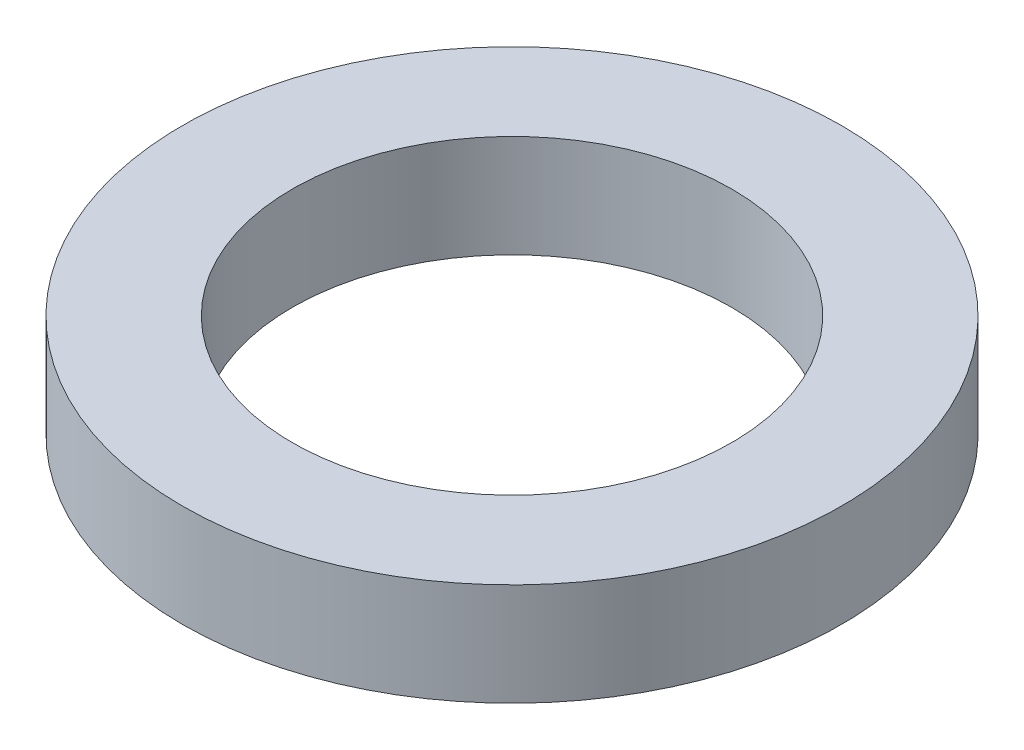
ISO-10303-21;
HEADER;
FILE_DESCRIPTION(('STEP AP214'),'2;1');
FILE_NAME('part.step','',(''),(''),'','','');
FILE_SCHEMA(('AUTOMOTIVE_DESIGN { 1 0 10303 214 1 1 1 1 }'));
ENDSEC;
DATA;
#1=APPLICATION_CONTEXT('core data for automotive mechanical design processes');
#2=APPLICATION_PROTOCOL_DEFINITION('international standard','automotive_design',2000,#1);
#3=PRODUCT_CONTEXT('',#1,'mechanical');
#4=PRODUCT('Part','Part','',(#3));
#5=PRODUCT_RELATED_PRODUCT_CATEGORY('part','',(#4));
#6=PRODUCT_DEFINITION_FORMATION('','',#4);
#7=PRODUCT_DEFINITION_CONTEXT('part definition',#1,'design');
#8=PRODUCT_DEFINITION('design','',#6,#7);
#9=PRODUCT_DEFINITION_SHAPE('','',#8);
#10=(LENGTH_UNIT() NAMED_UNIT(*) SI_UNIT(.MILLI.,.METRE.));
#11=(NAMED_UNIT(*) PLANE_ANGLE_UNIT() SI_UNIT($,.RADIAN.));
#12=(NAMED_UNIT(*) SI_UNIT($,.STERADIAN.) SOLID_ANGLE_UNIT());
#13=UNCERTAINTY_MEASURE_WITH_UNIT(LENGTH_MEASURE(1.E-05),#10,'distance_accuracy_value','');
#14=(GEOMETRIC_REPRESENTATION_CONTEXT(3) GLOBAL_UNCERTAINTY_ASSIGNED_CONTEXT((#13)) GLOBAL_UNIT_ASSIGNED_CONTEXT((#10,
#11,#12)) REPRESENTATION_CONTEXT('',''));
#15=CARTESIAN_POINT('',(0.,0.,0.));
#16=DIRECTION('',(0.,0.,1.));
#17=DIRECTION('',(1.,0.,0.));
#18=AXIS2_PLACEMENT_3D('',#15,#16,#17);
#19=CARTESIAN_POINT('',(0.,21.,0.));
#20=DIRECTION('',(0.,-1.,0.));
#21=DIRECTION('',(0.,0.,-1.));
#22=AXIS2_PLACEMENT_3D('',#19,#20,#21);
#23=CYLINDRICAL_SURFACE('',#22,67.5);
#24=CARTESIAN_POINT('',(0.,21.,0.));
#25=DIRECTION('',(0.,1.,0.));
#26=DIRECTION('',(0.,0.,1.));
#27=AXIS2_PLACEMENT_3D('',#24,#25,#26);
#28=CIRCLE('',#27,67.5);
#29=CARTESIAN_POINT('',(0.,21.,-67.5));
#30=VERTEX_POINT('',#29);
#31=EDGE_CURVE('E10',#30,#30,#28,.T.);
#32=CARTESIAN_POINT('',(0.,0.,0.));
#33=DIRECTION('',(0.,1.,0.));
#34=DIRECTION('',(0.,0.,1.));
#35=AXIS2_PLACEMENT_3D('',#32,#33,#34);
#36=CIRCLE('',#35,67.5);
#37=CARTESIAN_POINT('',(0.,0.,-67.5));
#38=VERTEX_POINT('',#37);
#39=EDGE_CURVE('E37',#38,#38,#36,.T.);
#40=CARTESIAN_POINT('',(0.,21.,-67.5));
#41=CARTESIAN_POINT('',(0.,20.78125,-67.5));
#42=CARTESIAN_POINT('',(0.,20.5625,-67.5));
#43=CARTESIAN_POINT('',(0.,20.125,-67.5));
#44=CARTESIAN_POINT('',(0.,19.90625,-67.5));
#45=CARTESIAN_POINT('',(0.,19.46875,-67.5));
#46=CARTESIAN_POINT('',(0.,19.25,-67.5));
#47=CARTESIAN_POINT('',(0.,18.8125,-67.5));
#48=CARTESIAN_POINT('',(0.,18.59375,-67.5));
#49=CARTESIAN_POINT('',(0.,18.15625,-67.5));
#50=CARTESIAN_POINT('',(0.,17.9375,-67.5));
#51=CARTESIAN_POINT('',(0.,17.5,-67.5));
#52=CARTESIAN_POINT('',(0.,17.28125,-67.5));
#53=CARTESIAN_POINT('',(0.,16.84375,-67.5));
#54=CARTESIAN_POINT('',(0.,16.625,-67.5));
#55=CARTESIAN_POINT('',(0.,16.1875,-67.5));
#56=CARTESIAN_POINT('',(0.,15.96875,-67.5));
#57=CARTESIAN_POINT('',(0.,15.53125,-67.5));
#58=CARTESIAN_POINT('',(0.,15.3125,-67.5));
#59=CARTESIAN_POINT('',(0.,14.875,-67.5));
#60=CARTESIAN_POINT('',(0.,14.65625,-67.5));
#61=CARTESIAN_POINT('',(0.,14.21875,-67.5));
#62=CARTESIAN_POINT('',(0.,14.,-67.5));
#63=CARTESIAN_POINT('',(0.,13.5625,-67.5));
#64=CARTESIAN_POINT('',(0.,13.34375,-67.5));
#65=CARTESIAN_POINT('',(0.,12.90625,-67.5));
#66=CARTESIAN_POINT('',(0.,12.6875,-67.5));
#67=CARTESIAN_POINT('',(0.,12.25,-67.5));
#68=CARTESIAN_POINT('',(0.,12.03125,-67.5));
#69=CARTESIAN_POINT('',(0.,11.59375,-67.5));
#70=CARTESIAN_POINT('',(0.,11.375,-67.5));
#71=CARTESIAN_POINT('',(0.,10.9375,-67.5));
#72=CARTESIAN_POINT('',(0.,10.71875,-67.5));
#73=CARTESIAN_POINT('',(0.,10.28125,-67.5));
#74=CARTESIAN_POINT('',(0.,10.0625,-67.5));
#75=CARTESIAN_POINT('',(0.,9.625,-67.5));
#76=CARTESIAN_POINT('',(0.,9.40625,-67.5));
#77=CARTESIAN_POINT('',(0.,8.96875,-67.5));
#78=CARTESIAN_POINT('',(0.,8.75,-67.5));
#79=CARTESIAN_POINT('',(0.,8.3125,-67.5));
#80=CARTESIAN_POINT('',(0.,8.09375,-67.5));
#81=CARTESIAN_POINT('',(0.,7.65625,-67.5));
#82=CARTESIAN_POINT('',(0.,7.4375,-67.5));
#83=CARTESIAN_POINT('',(0.,7.,-67.5));
#84=CARTESIAN_POINT('',(0.,6.78125,-67.5));
#85=CARTESIAN_POINT('',(0.,6.34375,-67.5));
#86=CARTESIAN_POINT('',(0.,6.125,-67.5));
#87=CARTESIAN_POINT('',(0.,5.6875,-67.5));
#88=CARTESIAN_POINT('',(0.,5.46875,-67.5));
#89=CARTESIAN_POINT('',(0.,5.03125,-67.5));
#90=CARTESIAN_POINT('',(0.,4.8125,-67.5));
#91=CARTESIAN_POINT('',(0.,4.375,-67.5));
#92=CARTESIAN_POINT('',(0.,4.15625,-67.5));
#93=CARTESIAN_POINT('',(0.,3.71875,-67.5));
#94=CARTESIAN_POINT('',(0.,3.5,-67.5));
#95=CARTESIAN_POINT('',(0.,3.0625,-67.5));
#96=CARTESIAN_POINT('',(0.,2.84375,-67.5));
#97=CARTESIAN_POINT('',(0.,2.40625,-67.5));
#98=CARTESIAN_POINT('',(0.,2.1875,-67.5));
#99=CARTESIAN_POINT('',(0.,1.75,-67.5));
#100=CARTESIAN_POINT('',(0.,1.53125,-67.5));
#101=CARTESIAN_POINT('',(0.,1.09375,-67.5));
#102=CARTESIAN_POINT('',(0.,0.875000000000001,-67.5));
#103=CARTESIAN_POINT('',(0.,0.4375,-67.5));
#104=CARTESIAN_POINT('',(0.,0.21875,-67.5));
#105=CARTESIAN_POINT('',(0.,0.,-67.5));
#106=B_SPLINE_CURVE_WITH_KNOTS('',3,(#40,#41,#42,#43,#44,#45,#46,#47,#48,#49,#50,#51,#52,#53,
#54,#55,#56,#57,#58,#59,#60,#61,#62,#63,#64,#65,#66,#67,#68,#69,#70,#71,#72,#73,#74,#75,#76,#77,
#78,#79,#80,#81,#82,#83,#84,#85,#86,#87,#88,#89,#90,#91,#92,#93,#94,#95,#96,#97,#98,#99,#100,
#101,#102,#103,#104,#105),.UNSPECIFIED.,.F.,.F.,(4,2,2,2,2,2,2,2,2,2,2,2,2,2,2,2,2,2,2,2,2,2,2,
2,2,2,2,2,2,2,2,2,4),(0.,0.656250000000001,1.3125,1.96875,2.625,3.28125,3.9375,4.59375,5.25,
5.90625,6.5625,7.21875,7.875,8.53125,9.1875,9.84375,10.5,11.15625,11.8125,12.46875,13.125,
13.78125,14.4375,15.09375,15.75,16.40625,17.0625,17.71875,18.375,19.03125,19.6875,20.34375,21.),.UNSPECIFIED.);
#107=EDGE_CURVE('BSEAM40',#30,#38,#106,.T.);
#108=ORIENTED_EDGE('',*,*,#31,.F.);
#109=ORIENTED_EDGE('',*,*,#39,.T.);
#110=ORIENTED_EDGE('',*,*,#107,.T.);
#111=ORIENTED_EDGE('',*,*,#107,.F.);
#112=EDGE_LOOP('',(#108,#110,#109,#111));
#113=FACE_BOUND('',#112,.T.);
#114=ADVANCED_FACE('F40',(#113),#23,.T.);
#115=CARTESIAN_POINT('',(0.,21.,0.));
#116=DIRECTION('',(0.,1.,0.));
#117=DIRECTION('',(0.,0.,1.));
#118=AXIS2_PLACEMENT_3D('',#115,#116,#117);
#119=PLANE('',#118);
#120=CARTESIAN_POINT('',(0.,21.,0.));
#121=DIRECTION('',(0.,1.,0.));
#122=DIRECTION('',(0.,0.,1.));
#123=AXIS2_PLACEMENT_3D('',#120,#121,#122);
#124=CIRCLE('',#123,45.);
#125=CARTESIAN_POINT('',(0.,21.,-45.));
#126=VERTEX_POINT('',#125);
#127=EDGE_CURVE('E50',#126,#126,#124,.T.);
#128=ORIENTED_EDGE('',*,*,#127,.F.);
#129=EDGE_LOOP('',(#128));
#130=FACE_BOUND('',#129,.T.);
#131=ORIENTED_EDGE('',*,*,#31,.T.);
#132=EDGE_LOOP('',(#131));
#133=FACE_BOUND('',#132,.T.);
#134=ADVANCED_FACE('F59',(#130,#133),#119,.T.);
#135=CARTESIAN_POINT('',(0.,0.,0.));
#136=DIRECTION('',(0.,1.,0.));
#137=DIRECTION('',(0.,0.,1.));
#138=AXIS2_PLACEMENT_3D('',#135,#136,#137);
#139=PLANE('',#138);
#140=CARTESIAN_POINT('',(0.,0.,0.));
#141=DIRECTION('',(0.,1.,0.));
#142=DIRECTION('',(0.,0.,1.));
#143=AXIS2_PLACEMENT_3D('',#140,#141,#142);
#144=CIRCLE('',#143,45.);
#145=CARTESIAN_POINT('',(0.,0.,-45.));
#146=VERTEX_POINT('',#145);
#147=EDGE_CURVE('E47',#146,#146,#144,.T.);
#148=ORIENTED_EDGE('',*,*,#147,.T.);
#149=EDGE_LOOP('',(#148));
#150=FACE_BOUND('',#149,.T.);
#151=ORIENTED_EDGE('',*,*,#39,.F.);
#152=EDGE_LOOP('',(#151));
#153=FACE_BOUND('',#152,.T.);
#154=ADVANCED_FACE('F58',(#150,#153),#139,.F.);
#155=CARTESIAN_POINT('',(0.,21.,0.));
#156=DIRECTION('',(0.,-1.,0.));
#157=DIRECTION('',(0.,0.,-1.));
#158=AXIS2_PLACEMENT_3D('',#155,#156,#157);
#159=CYLINDRICAL_SURFACE('',#158,45.);
#160=CARTESIAN_POINT('',(0.,21.,-45.));
#161=CARTESIAN_POINT('',(0.,20.78125,-45.));
#162=CARTESIAN_POINT('',(0.,20.5625,-45.));
#163=CARTESIAN_POINT('',(0.,20.125,-45.));
#164=CARTESIAN_POINT('',(0.,19.90625,-45.));
#165=CARTESIAN_POINT('',(0.,19.46875,-45.));
#166=CARTESIAN_POINT('',(0.,19.25,-45.));
#167=CARTESIAN_POINT('',(0.,18.8125,-45.));
#168=CARTESIAN_POINT('',(0.,18.59375,-45.));
#169=CARTESIAN_POINT('',(0.,18.15625,-45.));
#170=CARTESIAN_POINT('',(0.,17.9375,-45.));
#171=CARTESIAN_POINT('',(0.,17.5,-45.));
#172=CARTESIAN_POINT('',(0.,17.28125,-45.));
#173=CARTESIAN_POINT('',(0.,16.84375,-45.));
#174=CARTESIAN_POINT('',(0.,16.625,-45.));
#175=CARTESIAN_POINT('',(0.,16.1875,-45.));
#176=CARTESIAN_POINT('',(0.,15.96875,-45.));
#177=CARTESIAN_POINT('',(0.,15.53125,-45.));
#178=CARTESIAN_POINT('',(0.,15.3125,-45.));
#179=CARTESIAN_POINT('',(0.,14.875,-45.));
#180=CARTESIAN_POINT('',(0.,14.65625,-45.));
#181=CARTESIAN_POINT('',(0.,14.21875,-45.));
#182=CARTESIAN_POINT('',(0.,14.,-45.));
#183=CARTESIAN_POINT('',(0.,13.5625,-45.));
#184=CARTESIAN_POINT('',(0.,13.34375,-45.));
#185=CARTESIAN_POINT('',(0.,12.90625,-45.));
#186=CARTESIAN_POINT('',(0.,12.6875,-45.));
#187=CARTESIAN_POINT('',(0.,12.25,-45.));
#188=CARTESIAN_POINT('',(0.,12.03125,-45.));
#189=CARTESIAN_POINT('',(0.,11.59375,-45.));
#190=CARTESIAN_POINT('',(0.,11.375,-45.));
#191=CARTESIAN_POINT('',(0.,10.9375,-45.));
#192=CARTESIAN_POINT('',(0.,10.71875,-45.));
#193=CARTESIAN_POINT('',(0.,10.28125,-45.));
#194=CARTESIAN_POINT('',(0.,10.0625,-45.));
#195=CARTESIAN_POINT('',(0.,9.625,-45.));
#196=CARTESIAN_POINT('',(0.,9.40625,-45.));
#197=CARTESIAN_POINT('',(0.,8.96875,-45.));
#198=CARTESIAN_POINT('',(0.,8.75,-45.));
#199=CARTESIAN_POINT('',(0.,8.3125,-45.));
#200=CARTESIAN_POINT('',(0.,8.09375,-45.));
#201=CARTESIAN_POINT('',(0.,7.65625,-45.));
#202=CARTESIAN_POINT('',(0.,7.4375,-45.));
#203=CARTESIAN_POINT('',(0.,7.,-45.));
#204=CARTESIAN_POINT('',(0.,6.78125,-45.));
#205=CARTESIAN_POINT('',(0.,6.34375,-45.));
#206=CARTESIAN_POINT('',(0.,6.125,-45.));
#207=CARTESIAN_POINT('',(0.,5.6875,-45.));
#208=CARTESIAN_POINT('',(0.,5.46875,-45.));
#209=CARTESIAN_POINT('',(0.,5.03125,-45.));
#210=CARTESIAN_POINT('',(0.,4.8125,-45.));
#211=CARTESIAN_POINT('',(0.,4.375,-45.));
#212=CARTESIAN_POINT('',(0.,4.15625,-45.));
#213=CARTESIAN_POINT('',(0.,3.71875,-45.));
#214=CARTESIAN_POINT('',(0.,3.5,-45.));
#215=CARTESIAN_POINT('',(0.,3.0625,-45.));
#216=CARTESIAN_POINT('',(0.,2.84375,-45.));
#217=CARTESIAN_POINT('',(0.,2.40625,-45.));
#218=CARTESIAN_POINT('',(0.,2.1875,-45.));
#219=CARTESIAN_POINT('',(0.,1.75,-45.));
#220=CARTESIAN_POINT('',(0.,1.53125,-45.));
#221=CARTESIAN_POINT('',(0.,1.09375,-45.));
#222=CARTESIAN_POINT('',(0.,0.875000000000001,-45.));
#223=CARTESIAN_POINT('',(0.,0.4375,-45.));
#224=CARTESIAN_POINT('',(0.,0.21875,-45.));
#225=CARTESIAN_POINT('',(0.,0.,-45.));
#226=B_SPLINE_CURVE_WITH_KNOTS('',3,(#160,#161,#162,#163,#164,#165,#166,#167,#168,#169,#170,
#171,#172,#173,#174,#175,#176,#177,#178,#179,#180,#181,#182,#183,#184,#185,#186,#187,#188,#189,
#190,#191,#192,#193,#194,#195,#196,#197,#198,#199,#200,#201,#202,#203,#204,#205,#206,#207,#208,
#209,#210,#211,#212,#213,#214,#215,#216,#217,#218,#219,#220,#221,#222,#223,#224,#225),
.UNSPECIFIED.,.F.,.F.,(4,2,2,2,2,2,2,2,2,2,2,2,2,2,2,2,2,2,2,2,2,2,2,2,2,2,2,2,2,2,2,2,4),(0.,
0.656250000000001,1.3125,1.96875,2.625,3.28125,3.9375,4.59375,5.25,5.90625,6.5625,7.21875,7.875,
8.53125,9.1875,9.84375,10.5,11.15625,11.8125,12.46875,13.125,13.78125,14.4375,15.09375,15.75,
16.40625,17.0625,17.71875,18.375,19.03125,19.6875,20.34375,21.),.UNSPECIFIED.);
#227=EDGE_CURVE('BSEAM54',#126,#146,#226,.T.);
#228=ORIENTED_EDGE('',*,*,#127,.T.);
#229=ORIENTED_EDGE('',*,*,#147,.F.);
#230=ORIENTED_EDGE('',*,*,#227,.T.);
#231=ORIENTED_EDGE('',*,*,#227,.F.);
#232=EDGE_LOOP('',(#228,#230,#229,#231));
#233=FACE_BOUND('',#232,.T.);
#234=ADVANCED_FACE('F54',(#233),#159,.F.);
#235=CLOSED_SHELL('',(#114,#134,#154,#234));
#236=MANIFOLD_SOLID_BREP('B2',#235);
#237=ADVANCED_BREP_SHAPE_REPRESENTATION('',(#18,#236),#14);
#238=SHAPE_DEFINITION_REPRESENTATION(#9,#237);
ENDSEC;
END-ISO-10303-21;
